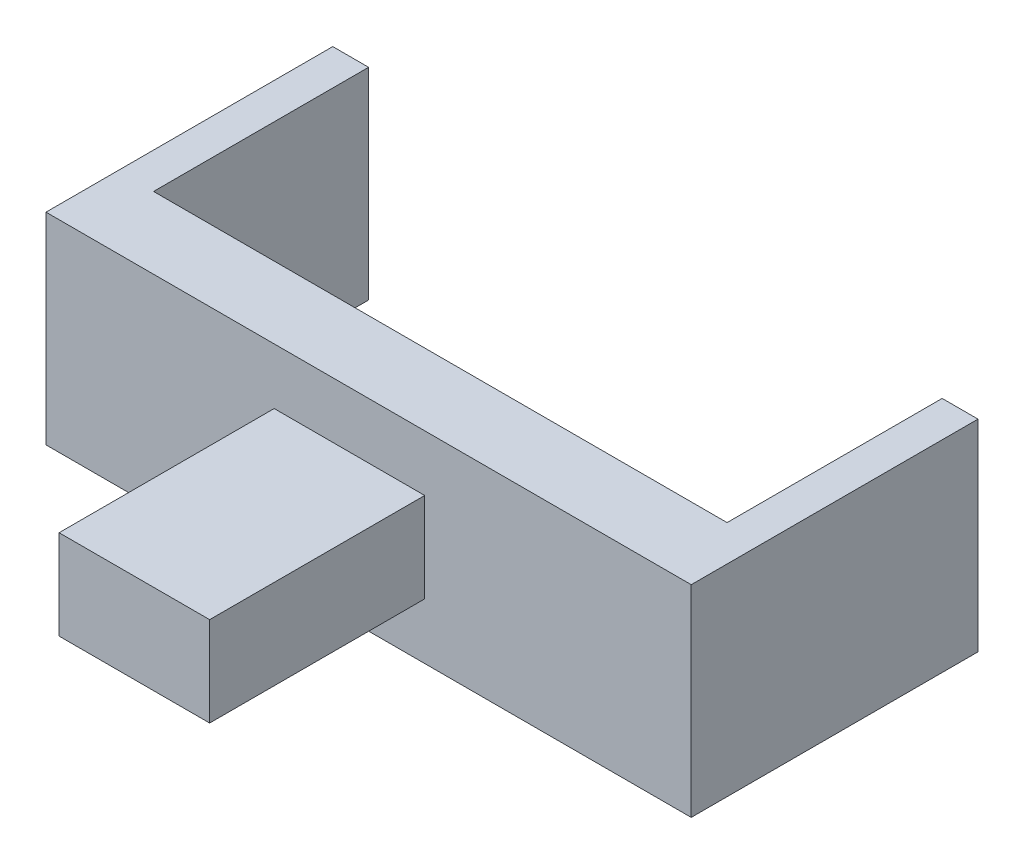
ISO-10303-21;
HEADER;
FILE_DESCRIPTION(('STEP AP214'),'2;1');
FILE_NAME('part.step','',(''),(''),'','','');
FILE_SCHEMA(('AUTOMOTIVE_DESIGN { 1 0 10303 214 1 1 1 1 }'));
ENDSEC;
DATA;
#1=APPLICATION_CONTEXT('core data for automotive mechanical design processes');
#2=APPLICATION_PROTOCOL_DEFINITION('international standard','automotive_design',2000,#1);
#3=PRODUCT_CONTEXT('',#1,'mechanical');
#4=PRODUCT('Part','Part','',(#3));
#5=PRODUCT_RELATED_PRODUCT_CATEGORY('part','',(#4));
#6=PRODUCT_DEFINITION_FORMATION('','',#4);
#7=PRODUCT_DEFINITION_CONTEXT('part definition',#1,'design');
#8=PRODUCT_DEFINITION('design','',#6,#7);
#9=PRODUCT_DEFINITION_SHAPE('','',#8);
#10=(LENGTH_UNIT() NAMED_UNIT(*) SI_UNIT(.MILLI.,.METRE.));
#11=(NAMED_UNIT(*) PLANE_ANGLE_UNIT() SI_UNIT($,.RADIAN.));
#12=(NAMED_UNIT(*) SI_UNIT($,.STERADIAN.) SOLID_ANGLE_UNIT());
#13=UNCERTAINTY_MEASURE_WITH_UNIT(LENGTH_MEASURE(1.E-05),#10,'distance_accuracy_value','');
#14=(GEOMETRIC_REPRESENTATION_CONTEXT(3) GLOBAL_UNCERTAINTY_ASSIGNED_CONTEXT((#13)) GLOBAL_UNIT_ASSIGNED_CONTEXT((#10,
#11,#12)) REPRESENTATION_CONTEXT('',''));
#15=CARTESIAN_POINT('',(0.,0.,0.));
#16=DIRECTION('',(0.,0.,1.));
#17=DIRECTION('',(1.,0.,0.));
#18=AXIS2_PLACEMENT_3D('',#15,#16,#17);
#19=CARTESIAN_POINT('',(0.,0.,0.));
#20=DIRECTION('',(0.,0.,1.));
#21=DIRECTION('',(1.,0.,0.));
#22=AXIS2_PLACEMENT_3D('',#19,#20,#21);
#23=PLANE('',#22);
#24=DIRECTION('',(-1.,0.,0.));
#25=VECTOR('',#24,1.);
#26=CARTESIAN_POINT('',(-42.3253549972423,17.5326298321326,0.));
#27=LINE('',#26,#25);
#28=CARTESIAN_POINT('',(42.6746450027577,17.5326298321326,0.));
#29=VERTEX_POINT('',#28);
#30=CARTESIAN_POINT('',(-37.3253549972423,17.5326298321326,0.));
#31=VERTEX_POINT('',#30);
#32=EDGE_CURVE('E57',#29,#31,#27,.T.);
#33=ORIENTED_EDGE('',*,*,#32,.F.);
#34=DIRECTION('',(0.,-1.,0.));
#35=VECTOR('',#34,1.);
#36=CARTESIAN_POINT('',(42.6746450027577,0.,0.));
#37=LINE('',#36,#35);
#38=CARTESIAN_POINT('',(42.6746450027577,-10.5830726472062,0.));
#39=VERTEX_POINT('',#38);
#40=EDGE_CURVE('E50',#29,#39,#37,.T.);
#41=ORIENTED_EDGE('',*,*,#40,.T.);
#42=DIRECTION('',(1.,0.,0.));
#43=VECTOR('',#42,1.);
#44=CARTESIAN_POINT('',(-42.3253549972423,-10.5830726472062,0.));
#45=LINE('',#44,#43);
#46=CARTESIAN_POINT('',(-37.3253549972423,-10.5830726472062,0.));
#47=VERTEX_POINT('',#46);
#48=EDGE_CURVE('E203',#47,#39,#45,.T.);
#49=ORIENTED_EDGE('',*,*,#48,.F.);
#50=DIRECTION('',(0.,-1.,0.));
#51=VECTOR('',#50,1.);
#52=CARTESIAN_POINT('',(-37.3253549972423,0.,0.));
#53=LINE('',#52,#51);
#54=EDGE_CURVE('E127',#31,#47,#53,.T.);
#55=ORIENTED_EDGE('',*,*,#54,.F.);
#56=EDGE_LOOP('',(#33,#41,#49,#55));
#57=FACE_BOUND('',#56,.T.);
#58=ADVANCED_FACE('F35',(#57),#23,.F.);
#59=CARTESIAN_POINT('',(-42.3253549972423,17.5326298321326,10.));
#60=DIRECTION('',(1.,0.,0.));
#61=DIRECTION('',(0.,0.,-1.));
#62=AXIS2_PLACEMENT_3D('',#59,#60,#61);
#63=PLANE('',#62);
#64=DIRECTION('',(0.,0.,-1.));
#65=VECTOR('',#64,1.);
#66=CARTESIAN_POINT('',(-42.3253549972423,17.5326298321326,10.));
#67=LINE('',#66,#65);
#68=CARTESIAN_POINT('',(-42.3253549972423,17.5326298321326,10.));
#69=VERTEX_POINT('',#68);
#70=CARTESIAN_POINT('',(-42.3253549972423,17.5326298321326,-30.));
#71=VERTEX_POINT('',#70);
#72=EDGE_CURVE('E213',#69,#71,#67,.T.);
#73=ORIENTED_EDGE('',*,*,#72,.T.);
#74=DIRECTION('',(0.,1.,0.));
#75=VECTOR('',#74,1.);
#76=CARTESIAN_POINT('',(-42.3253549972423,0.,-30.));
#77=LINE('',#76,#75);
#78=CARTESIAN_POINT('',(-42.3253549972423,-10.5830726472062,-30.));
#79=VERTEX_POINT('',#78);
#80=EDGE_CURVE('E159',#79,#71,#77,.T.);
#81=ORIENTED_EDGE('',*,*,#80,.F.);
#82=DIRECTION('',(0.,0.,-1.));
#83=VECTOR('',#82,1.);
#84=CARTESIAN_POINT('',(-42.3253549972423,-10.5830726472062,10.));
#85=LINE('',#84,#83);
#86=CARTESIAN_POINT('',(-42.3253549972423,-10.5830726472062,10.));
#87=VERTEX_POINT('',#86);
#88=EDGE_CURVE('E11',#87,#79,#85,.T.);
#89=ORIENTED_EDGE('',*,*,#88,.F.);
#90=DIRECTION('',(0.,-1.,0.));
#91=VECTOR('',#90,1.);
#92=CARTESIAN_POINT('',(-42.3253549972423,17.5326298321326,10.));
#93=LINE('',#92,#91);
#94=EDGE_CURVE('E204',#69,#87,#93,.T.);
#95=ORIENTED_EDGE('',*,*,#94,.F.);
#96=EDGE_LOOP('',(#73,#81,#89,#95));
#97=FACE_BOUND('',#96,.T.);
#98=ADVANCED_FACE('F37',(#97),#63,.F.);
#99=CARTESIAN_POINT('',(-42.3253549972423,-10.5830726472062,10.));
#100=DIRECTION('',(0.,1.,0.));
#101=DIRECTION('',(0.,0.,1.));
#102=AXIS2_PLACEMENT_3D('',#99,#100,#101);
#103=PLANE('',#102);
#104=ORIENTED_EDGE('',*,*,#88,.T.);
#105=DIRECTION('',(-1.,0.,0.));
#106=VECTOR('',#105,1.);
#107=CARTESIAN_POINT('',(0.,-10.5830726472062,-30.));
#108=LINE('',#107,#106);
#109=CARTESIAN_POINT('',(-37.3253549972423,-10.5830726472062,-30.));
#110=VERTEX_POINT('',#109);
#111=EDGE_CURVE('E156',#110,#79,#108,.T.);
#112=ORIENTED_EDGE('',*,*,#111,.F.);
#113=DIRECTION('',(0.,0.,1.));
#114=VECTOR('',#113,1.);
#115=CARTESIAN_POINT('',(-37.3253549972423,-10.5830726472062,-30.));
#116=LINE('',#115,#114);
#117=EDGE_CURVE('E162',#110,#47,#116,.T.);
#118=ORIENTED_EDGE('',*,*,#117,.T.);
#119=ORIENTED_EDGE('',*,*,#48,.T.);
#120=DIRECTION('',(0.,0.,1.));
#121=VECTOR('',#120,1.);
#122=CARTESIAN_POINT('',(42.6746450027577,-10.5830726472062,-30.));
#123=LINE('',#122,#121);
#124=CARTESIAN_POINT('',(42.6746450027577,-10.5830726472062,-30.));
#125=VERTEX_POINT('',#124);
#126=EDGE_CURVE('E128',#125,#39,#123,.T.);
#127=ORIENTED_EDGE('',*,*,#126,.F.);
#128=DIRECTION('',(-1.,0.,0.));
#129=VECTOR('',#128,1.);
#130=CARTESIAN_POINT('',(0.,-10.5830726472062,-30.));
#131=LINE('',#130,#129);
#132=CARTESIAN_POINT('',(47.6746450027577,-10.5830726472062,-30.));
#133=VERTEX_POINT('',#132);
#134=EDGE_CURVE('E143',#133,#125,#131,.T.);
#135=ORIENTED_EDGE('',*,*,#134,.F.);
#136=DIRECTION('',(0.,0.,-1.));
#137=VECTOR('',#136,1.);
#138=CARTESIAN_POINT('',(47.6746450027577,-10.5830726472062,10.));
#139=LINE('',#138,#137);
#140=CARTESIAN_POINT('',(47.6746450027577,-10.5830726472062,10.));
#141=VERTEX_POINT('',#140);
#142=EDGE_CURVE('E43',#141,#133,#139,.T.);
#143=ORIENTED_EDGE('',*,*,#142,.F.);
#144=DIRECTION('',(1.,0.,0.));
#145=VECTOR('',#144,1.);
#146=CARTESIAN_POINT('',(-42.3253549972423,-10.5830726472062,10.));
#147=LINE('',#146,#145);
#148=EDGE_CURVE('E207',#87,#141,#147,.T.);
#149=ORIENTED_EDGE('',*,*,#148,.F.);
#150=EDGE_LOOP('',(#104,#112,#118,#119,#127,#135,#143,#149));
#151=FACE_BOUND('',#150,.T.);
#152=ADVANCED_FACE('F223',(#151),#103,.F.);
#153=CARTESIAN_POINT('',(47.6746450027577,17.5326298321326,10.));
#154=DIRECTION('',(-1.,0.,0.));
#155=DIRECTION('',(0.,0.,1.));
#156=AXIS2_PLACEMENT_3D('',#153,#154,#155);
#157=PLANE('',#156);
#158=ORIENTED_EDGE('',*,*,#142,.T.);
#159=DIRECTION('',(0.,-1.,0.));
#160=VECTOR('',#159,1.);
#161=CARTESIAN_POINT('',(47.6746450027577,0.,-30.));
#162=LINE('',#161,#160);
#163=CARTESIAN_POINT('',(47.6746450027577,17.5326298321326,-30.));
#164=VERTEX_POINT('',#163);
#165=EDGE_CURVE('E139',#164,#133,#162,.T.);
#166=ORIENTED_EDGE('',*,*,#165,.F.);
#167=DIRECTION('',(0.,0.,-1.));
#168=VECTOR('',#167,1.);
#169=CARTESIAN_POINT('',(47.6746450027577,17.5326298321326,10.));
#170=LINE('',#169,#168);
#171=CARTESIAN_POINT('',(47.6746450027577,17.5326298321326,10.));
#172=VERTEX_POINT('',#171);
#173=EDGE_CURVE('E135',#172,#164,#170,.T.);
#174=ORIENTED_EDGE('',*,*,#173,.F.);
#175=DIRECTION('',(0.,1.,0.));
#176=VECTOR('',#175,1.);
#177=CARTESIAN_POINT('',(47.6746450027577,17.5326298321326,10.));
#178=LINE('',#177,#176);
#179=EDGE_CURVE('E209',#141,#172,#178,.T.);
#180=ORIENTED_EDGE('',*,*,#179,.F.);
#181=EDGE_LOOP('',(#158,#166,#174,#180));
#182=FACE_BOUND('',#181,.T.);
#183=ADVANCED_FACE('F221',(#182),#157,.F.);
#184=CARTESIAN_POINT('',(-42.3253549972423,17.5326298321326,10.));
#185=DIRECTION('',(0.,-1.,0.));
#186=DIRECTION('',(0.,0.,-1.));
#187=AXIS2_PLACEMENT_3D('',#184,#185,#186);
#188=PLANE('',#187);
#189=ORIENTED_EDGE('',*,*,#173,.T.);
#190=DIRECTION('',(1.,0.,0.));
#191=VECTOR('',#190,1.);
#192=CARTESIAN_POINT('',(0.,17.5326298321326,-30.));
#193=LINE('',#192,#191);
#194=CARTESIAN_POINT('',(42.6746450027577,17.5326298321326,-30.));
#195=VERTEX_POINT('',#194);
#196=EDGE_CURVE('E131',#195,#164,#193,.T.);
#197=ORIENTED_EDGE('',*,*,#196,.F.);
#198=DIRECTION('',(0.,0.,1.));
#199=VECTOR('',#198,1.);
#200=CARTESIAN_POINT('',(42.6746450027577,17.5326298321326,-30.));
#201=LINE('',#200,#199);
#202=EDGE_CURVE('E122',#195,#29,#201,.T.);
#203=ORIENTED_EDGE('',*,*,#202,.T.);
#204=ORIENTED_EDGE('',*,*,#32,.T.);
#205=DIRECTION('',(0.,0.,1.));
#206=VECTOR('',#205,1.);
#207=CARTESIAN_POINT('',(-37.3253549972423,17.5326298321326,-30.));
#208=LINE('',#207,#206);
#209=CARTESIAN_POINT('',(-37.3253549972423,17.5326298321326,-30.));
#210=VERTEX_POINT('',#209);
#211=EDGE_CURVE('E167',#210,#31,#208,.T.);
#212=ORIENTED_EDGE('',*,*,#211,.F.);
#213=DIRECTION('',(1.,0.,0.));
#214=VECTOR('',#213,1.);
#215=CARTESIAN_POINT('',(0.,17.5326298321326,-30.));
#216=LINE('',#215,#214);
#217=EDGE_CURVE('E151',#71,#210,#216,.T.);
#218=ORIENTED_EDGE('',*,*,#217,.F.);
#219=ORIENTED_EDGE('',*,*,#72,.F.);
#220=DIRECTION('',(-1.,0.,0.));
#221=VECTOR('',#220,1.);
#222=CARTESIAN_POINT('',(-42.3253549972423,17.5326298321326,10.));
#223=LINE('',#222,#221);
#224=EDGE_CURVE('E211',#172,#69,#223,.T.);
#225=ORIENTED_EDGE('',*,*,#224,.F.);
#226=EDGE_LOOP('',(#189,#197,#203,#204,#212,#218,#219,#225));
#227=FACE_BOUND('',#226,.T.);
#228=ADVANCED_FACE('F132',(#227),#188,.F.);
#229=CARTESIAN_POINT('',(0.,0.,10.));
#230=DIRECTION('',(0.,0.,1.));
#231=DIRECTION('',(1.,0.,0.));
#232=AXIS2_PLACEMENT_3D('',#229,#230,#231);
#233=PLANE('',#232);
#234=DIRECTION('',(0.,1.,0.));
#235=VECTOR('',#234,1.);
#236=CARTESIAN_POINT('',(10.4996096255826,-2.77142502210033,10.));
#237=LINE('',#236,#235);
#238=CARTESIAN_POINT('',(10.4996096255826,-2.77142502210033,10.));
#239=VERTEX_POINT('',#238);
#240=CARTESIAN_POINT('',(10.4996096255826,9.72098220702673,10.));
#241=VERTEX_POINT('',#240);
#242=EDGE_CURVE('E170',#239,#241,#237,.T.);
#243=ORIENTED_EDGE('',*,*,#242,.F.);
#244=DIRECTION('',(1.,0.,0.));
#245=VECTOR('',#244,1.);
#246=CARTESIAN_POINT('',(-10.4996096255826,-2.77142502210033,10.));
#247=LINE('',#246,#245);
#248=CARTESIAN_POINT('',(-10.4996096255826,-2.77142502210033,10.));
#249=VERTEX_POINT('',#248);
#250=EDGE_CURVE('E175',#249,#239,#247,.T.);
#251=ORIENTED_EDGE('',*,*,#250,.F.);
#252=DIRECTION('',(0.,-1.,0.));
#253=VECTOR('',#252,1.);
#254=CARTESIAN_POINT('',(-10.4996096255826,-2.77142502210033,10.));
#255=LINE('',#254,#253);
#256=CARTESIAN_POINT('',(-10.4996096255826,9.72098220702673,10.));
#257=VERTEX_POINT('',#256);
#258=EDGE_CURVE('E187',#257,#249,#255,.T.);
#259=ORIENTED_EDGE('',*,*,#258,.F.);
#260=DIRECTION('',(-1.,0.,0.));
#261=VECTOR('',#260,1.);
#262=CARTESIAN_POINT('',(-10.4996096255826,9.72098220702673,10.));
#263=LINE('',#262,#261);
#264=EDGE_CURVE('E184',#241,#257,#263,.T.);
#265=ORIENTED_EDGE('',*,*,#264,.F.);
#266=EDGE_LOOP('',(#243,#251,#259,#265));
#267=FACE_BOUND('',#266,.T.);
#268=ORIENTED_EDGE('',*,*,#94,.T.);
#269=ORIENTED_EDGE('',*,*,#148,.T.);
#270=ORIENTED_EDGE('',*,*,#179,.T.);
#271=ORIENTED_EDGE('',*,*,#224,.T.);
#272=EDGE_LOOP('',(#268,#269,#270,#271));
#273=FACE_BOUND('',#272,.T.);
#274=ADVANCED_FACE('F238',(#267,#273),#233,.T.);
#275=CARTESIAN_POINT('',(10.4996096255826,-2.77142502210033,40.));
#276=DIRECTION('',(-1.,0.,0.));
#277=DIRECTION('',(0.,0.,1.));
#278=AXIS2_PLACEMENT_3D('',#275,#276,#277);
#279=PLANE('',#278);
#280=ORIENTED_EDGE('',*,*,#242,.T.);
#281=DIRECTION('',(0.,0.,-1.));
#282=VECTOR('',#281,1.);
#283=CARTESIAN_POINT('',(10.4996096255826,9.72098220702673,40.));
#284=LINE('',#283,#282);
#285=CARTESIAN_POINT('',(10.4996096255826,9.72098220702673,40.));
#286=VERTEX_POINT('',#285);
#287=EDGE_CURVE('E200',#286,#241,#284,.T.);
#288=ORIENTED_EDGE('',*,*,#287,.F.);
#289=DIRECTION('',(0.,1.,0.));
#290=VECTOR('',#289,1.);
#291=CARTESIAN_POINT('',(10.4996096255826,-2.77142502210033,40.));
#292=LINE('',#291,#290);
#293=CARTESIAN_POINT('',(10.4996096255826,-2.77142502210033,40.));
#294=VERTEX_POINT('',#293);
#295=EDGE_CURVE('E171',#294,#286,#292,.T.);
#296=ORIENTED_EDGE('',*,*,#295,.F.);
#297=DIRECTION('',(0.,0.,-1.));
#298=VECTOR('',#297,1.);
#299=CARTESIAN_POINT('',(10.4996096255826,-2.77142502210033,40.));
#300=LINE('',#299,#298);
#301=EDGE_CURVE('E181',#294,#239,#300,.T.);
#302=ORIENTED_EDGE('',*,*,#301,.T.);
#303=EDGE_LOOP('',(#280,#288,#296,#302));
#304=FACE_BOUND('',#303,.T.);
#305=ADVANCED_FACE('F240',(#304),#279,.F.);
#306=CARTESIAN_POINT('',(-10.4996096255826,9.72098220702673,40.));
#307=DIRECTION('',(0.,-1.,0.));
#308=DIRECTION('',(0.,0.,-1.));
#309=AXIS2_PLACEMENT_3D('',#306,#307,#308);
#310=PLANE('',#309);
#311=ORIENTED_EDGE('',*,*,#264,.T.);
#312=DIRECTION('',(0.,0.,-1.));
#313=VECTOR('',#312,1.);
#314=CARTESIAN_POINT('',(-10.4996096255826,9.72098220702673,40.));
#315=LINE('',#314,#313);
#316=CARTESIAN_POINT('',(-10.4996096255826,9.72098220702673,40.));
#317=VERTEX_POINT('',#316);
#318=EDGE_CURVE('E197',#317,#257,#315,.T.);
#319=ORIENTED_EDGE('',*,*,#318,.F.);
#320=DIRECTION('',(-1.,0.,0.));
#321=VECTOR('',#320,1.);
#322=CARTESIAN_POINT('',(-10.4996096255826,9.72098220702673,40.));
#323=LINE('',#322,#321);
#324=EDGE_CURVE('E174',#286,#317,#323,.T.);
#325=ORIENTED_EDGE('',*,*,#324,.F.);
#326=ORIENTED_EDGE('',*,*,#287,.T.);
#327=EDGE_LOOP('',(#311,#319,#325,#326));
#328=FACE_BOUND('',#327,.T.);
#329=ADVANCED_FACE('F247',(#328),#310,.F.);
#330=CARTESIAN_POINT('',(-10.4996096255826,-2.77142502210033,40.));
#331=DIRECTION('',(1.,0.,0.));
#332=DIRECTION('',(0.,0.,-1.));
#333=AXIS2_PLACEMENT_3D('',#330,#331,#332);
#334=PLANE('',#333);
#335=ORIENTED_EDGE('',*,*,#258,.T.);
#336=DIRECTION('',(0.,0.,-1.));
#337=VECTOR('',#336,1.);
#338=CARTESIAN_POINT('',(-10.4996096255826,-2.77142502210033,40.));
#339=LINE('',#338,#337);
#340=CARTESIAN_POINT('',(-10.4996096255826,-2.77142502210033,40.));
#341=VERTEX_POINT('',#340);
#342=EDGE_CURVE('E194',#341,#249,#339,.T.);
#343=ORIENTED_EDGE('',*,*,#342,.F.);
#344=DIRECTION('',(0.,-1.,0.));
#345=VECTOR('',#344,1.);
#346=CARTESIAN_POINT('',(-10.4996096255826,-2.77142502210033,40.));
#347=LINE('',#346,#345);
#348=EDGE_CURVE('E177',#317,#341,#347,.T.);
#349=ORIENTED_EDGE('',*,*,#348,.F.);
#350=ORIENTED_EDGE('',*,*,#318,.T.);
#351=EDGE_LOOP('',(#335,#343,#349,#350));
#352=FACE_BOUND('',#351,.T.);
#353=ADVANCED_FACE('F316',(#352),#334,.F.);
#354=CARTESIAN_POINT('',(-10.4996096255826,-2.77142502210033,40.));
#355=DIRECTION('',(0.,1.,0.));
#356=DIRECTION('',(0.,0.,1.));
#357=AXIS2_PLACEMENT_3D('',#354,#355,#356);
#358=PLANE('',#357);
#359=ORIENTED_EDGE('',*,*,#250,.T.);
#360=ORIENTED_EDGE('',*,*,#301,.F.);
#361=DIRECTION('',(1.,0.,0.));
#362=VECTOR('',#361,1.);
#363=CARTESIAN_POINT('',(-10.4996096255826,-2.77142502210033,40.));
#364=LINE('',#363,#362);
#365=EDGE_CURVE('E179',#341,#294,#364,.T.);
#366=ORIENTED_EDGE('',*,*,#365,.F.);
#367=ORIENTED_EDGE('',*,*,#342,.T.);
#368=EDGE_LOOP('',(#359,#360,#366,#367));
#369=FACE_BOUND('',#368,.T.);
#370=ADVANCED_FACE('F312',(#369),#358,.F.);
#371=CARTESIAN_POINT('',(0.,0.,40.));
#372=DIRECTION('',(0.,0.,-1.));
#373=DIRECTION('',(-1.,0.,0.));
#374=AXIS2_PLACEMENT_3D('',#371,#372,#373);
#375=PLANE('',#374);
#376=ORIENTED_EDGE('',*,*,#295,.T.);
#377=ORIENTED_EDGE('',*,*,#324,.T.);
#378=ORIENTED_EDGE('',*,*,#348,.T.);
#379=ORIENTED_EDGE('',*,*,#365,.T.);
#380=EDGE_LOOP('',(#376,#377,#378,#379));
#381=FACE_BOUND('',#380,.T.);
#382=ADVANCED_FACE('F281',(#381),#375,.F.);
#383=CARTESIAN_POINT('',(-37.3253549972423,0.,-30.));
#384=DIRECTION('',(-1.,0.,0.));
#385=DIRECTION('',(0.,-1.,0.));
#386=AXIS2_PLACEMENT_3D('',#383,#384,#385);
#387=PLANE('',#386);
#388=ORIENTED_EDGE('',*,*,#54,.T.);
#389=ORIENTED_EDGE('',*,*,#117,.F.);
#390=DIRECTION('',(0.,-1.,0.));
#391=VECTOR('',#390,1.);
#392=CARTESIAN_POINT('',(-37.3253549972423,0.,-30.));
#393=LINE('',#392,#391);
#394=EDGE_CURVE('E154',#210,#110,#393,.T.);
#395=ORIENTED_EDGE('',*,*,#394,.F.);
#396=ORIENTED_EDGE('',*,*,#211,.T.);
#397=EDGE_LOOP('',(#388,#389,#395,#396));
#398=FACE_BOUND('',#397,.T.);
#399=ADVANCED_FACE('F227',(#398),#387,.F.);
#400=CARTESIAN_POINT('',(0.,0.,-30.));
#401=DIRECTION('',(0.,0.,-1.));
#402=DIRECTION('',(-1.,0.,0.));
#403=AXIS2_PLACEMENT_3D('',#400,#401,#402);
#404=PLANE('',#403);
#405=ORIENTED_EDGE('',*,*,#217,.T.);
#406=ORIENTED_EDGE('',*,*,#394,.T.);
#407=ORIENTED_EDGE('',*,*,#111,.T.);
#408=ORIENTED_EDGE('',*,*,#80,.T.);
#409=EDGE_LOOP('',(#405,#406,#407,#408));
#410=FACE_BOUND('',#409,.T.);
#411=ADVANCED_FACE('F232',(#410),#404,.T.);
#412=CARTESIAN_POINT('',(42.6746450027577,0.,-30.));
#413=DIRECTION('',(-1.,0.,0.));
#414=DIRECTION('',(0.,-1.,0.));
#415=AXIS2_PLACEMENT_3D('',#412,#413,#414);
#416=PLANE('',#415);
#417=ORIENTED_EDGE('',*,*,#40,.F.);
#418=ORIENTED_EDGE('',*,*,#202,.F.);
#419=DIRECTION('',(0.,-1.,0.));
#420=VECTOR('',#419,1.);
#421=CARTESIAN_POINT('',(42.6746450027577,0.,-30.));
#422=LINE('',#421,#420);
#423=EDGE_CURVE('E126',#195,#125,#422,.T.);
#424=ORIENTED_EDGE('',*,*,#423,.T.);
#425=ORIENTED_EDGE('',*,*,#126,.T.);
#426=EDGE_LOOP('',(#417,#418,#424,#425));
#427=FACE_BOUND('',#426,.T.);
#428=ADVANCED_FACE('F124',(#427),#416,.T.);
#429=CARTESIAN_POINT('',(0.,0.,-30.));
#430=DIRECTION('',(0.,0.,-1.));
#431=DIRECTION('',(-1.,0.,0.));
#432=AXIS2_PLACEMENT_3D('',#429,#430,#431);
#433=PLANE('',#432);
#434=ORIENTED_EDGE('',*,*,#423,.F.);
#435=ORIENTED_EDGE('',*,*,#196,.T.);
#436=ORIENTED_EDGE('',*,*,#165,.T.);
#437=ORIENTED_EDGE('',*,*,#134,.T.);
#438=EDGE_LOOP('',(#434,#435,#436,#437));
#439=FACE_BOUND('',#438,.T.);
#440=ADVANCED_FACE('F141',(#439),#433,.T.);
#441=CLOSED_SHELL('',(#58,#98,#152,#183,#228,#274,#305,#329,#353,#370,#382,#399,#411,#428,#440));
#442=MANIFOLD_SOLID_BREP('B2',#441);
#443=ADVANCED_BREP_SHAPE_REPRESENTATION('',(#18,#442),#14);
#444=SHAPE_DEFINITION_REPRESENTATION(#9,#443);
ENDSEC;
END-ISO-10303-21;
